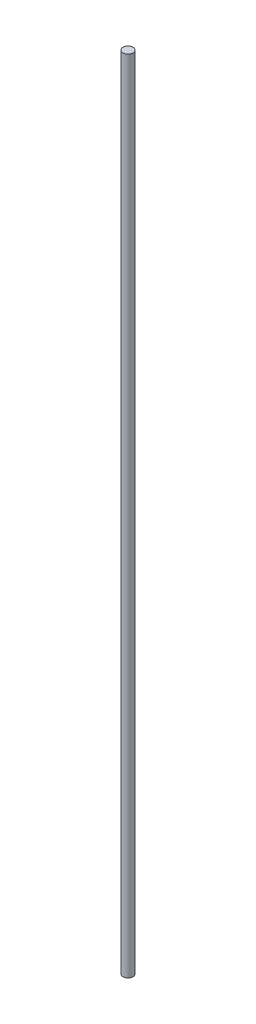
ISO-10303-21;
HEADER;
FILE_DESCRIPTION(('STEP AP214'),'2;1');
FILE_NAME('part.step','',(''),(''),'','','');
FILE_SCHEMA(('AUTOMOTIVE_DESIGN { 1 0 10303 214 1 1 1 1 }'));
ENDSEC;
DATA;
#1=APPLICATION_CONTEXT('core data for automotive mechanical design processes');
#2=APPLICATION_PROTOCOL_DEFINITION('international standard','automotive_design',2000,#1);
#3=PRODUCT_CONTEXT('',#1,'mechanical');
#4=PRODUCT('Part','Part','',(#3));
#5=PRODUCT_RELATED_PRODUCT_CATEGORY('part','',(#4));
#6=PRODUCT_DEFINITION_FORMATION('','',#4);
#7=PRODUCT_DEFINITION_CONTEXT('part definition',#1,'design');
#8=PRODUCT_DEFINITION('design','',#6,#7);
#9=PRODUCT_DEFINITION_SHAPE('','',#8);
#10=(LENGTH_UNIT() NAMED_UNIT(*) SI_UNIT(.MILLI.,.METRE.));
#11=(NAMED_UNIT(*) PLANE_ANGLE_UNIT() SI_UNIT($,.RADIAN.));
#12=(NAMED_UNIT(*) SI_UNIT($,.STERADIAN.) SOLID_ANGLE_UNIT());
#13=UNCERTAINTY_MEASURE_WITH_UNIT(LENGTH_MEASURE(1.E-05),#10,'distance_accuracy_value','');
#14=(GEOMETRIC_REPRESENTATION_CONTEXT(3) GLOBAL_UNCERTAINTY_ASSIGNED_CONTEXT((#13)) GLOBAL_UNIT_ASSIGNED_CONTEXT((#10,
#11,#12)) REPRESENTATION_CONTEXT('',''));
#15=CARTESIAN_POINT('',(0.,0.,0.));
#16=DIRECTION('',(0.,0.,1.));
#17=DIRECTION('',(1.,0.,0.));
#18=AXIS2_PLACEMENT_3D('',#15,#16,#17);
#19=CARTESIAN_POINT('',(0.,1012.,0.));
#20=DIRECTION('',(0.,-1.,0.));
#21=DIRECTION('',(0.,0.,-1.));
#22=AXIS2_PLACEMENT_3D('',#19,#20,#21);
#23=CYLINDRICAL_SURFACE('',#22,6.35);
#24=CARTESIAN_POINT('',(0.,1012.,0.));
#25=DIRECTION('',(0.,1.,0.));
#26=DIRECTION('',(0.,0.,1.));
#27=AXIS2_PLACEMENT_3D('',#24,#25,#26);
#28=CIRCLE('',#27,6.35);
#29=CARTESIAN_POINT('',(0.,1012.,6.35));
#30=VERTEX_POINT('',#29);
#31=EDGE_CURVE('E10',#30,#30,#28,.T.);
#32=ORIENTED_EDGE('',*,*,#31,.F.);
#33=EDGE_LOOP('',(#32));
#34=FACE_BOUND('',#33,.T.);
#35=CARTESIAN_POINT('',(0.,0.,0.));
#36=DIRECTION('',(0.,1.,0.));
#37=DIRECTION('',(0.,0.,1.));
#38=AXIS2_PLACEMENT_3D('',#35,#36,#37);
#39=CIRCLE('',#38,6.35);
#40=CARTESIAN_POINT('',(0.,0.,6.35));
#41=VERTEX_POINT('',#40);
#42=EDGE_CURVE('E42',#41,#41,#39,.T.);
#43=ORIENTED_EDGE('',*,*,#42,.T.);
#44=EDGE_LOOP('',(#43));
#45=FACE_BOUND('',#44,.T.);
#46=ADVANCED_FACE('F39',(#34,#45),#23,.T.);
#47=CARTESIAN_POINT('',(0.,1012.,0.));
#48=DIRECTION('',(0.,1.,0.));
#49=DIRECTION('',(0.,0.,1.));
#50=AXIS2_PLACEMENT_3D('',#47,#48,#49);
#51=PLANE('',#50);
#52=ORIENTED_EDGE('',*,*,#31,.T.);
#53=EDGE_LOOP('',(#52));
#54=FACE_BOUND('',#53,.T.);
#55=ADVANCED_FACE('F54',(#54),#51,.T.);
#56=CARTESIAN_POINT('',(0.,0.,0.));
#57=DIRECTION('',(0.,1.,0.));
#58=DIRECTION('',(0.,0.,1.));
#59=AXIS2_PLACEMENT_3D('',#56,#57,#58);
#60=PLANE('',#59);
#61=ORIENTED_EDGE('',*,*,#42,.F.);
#62=EDGE_LOOP('',(#61));
#63=FACE_BOUND('',#62,.T.);
#64=ADVANCED_FACE('F52',(#63),#60,.F.);
#65=CLOSED_SHELL('',(#46,#55,#64));
#66=MANIFOLD_SOLID_BREP('B2',#65);
#67=ADVANCED_BREP_SHAPE_REPRESENTATION('',(#18,#66),#14);
#68=SHAPE_DEFINITION_REPRESENTATION(#9,#67);
ENDSEC;
END-ISO-10303-21;
